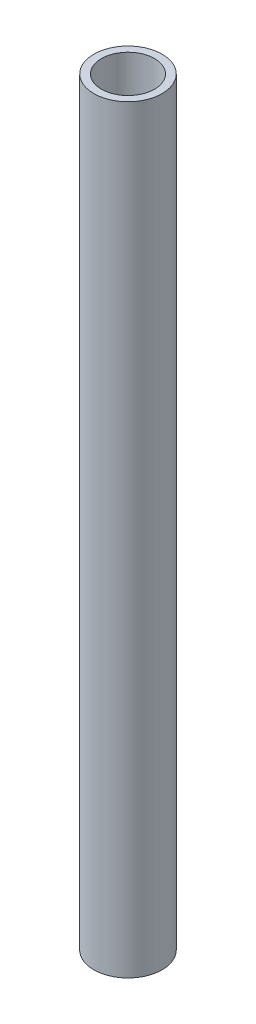
ISO-10303-21;
HEADER;
FILE_DESCRIPTION(('STEP AP214'),'2;1');
FILE_NAME('part.step','',(''),(''),'','','');
FILE_SCHEMA(('AUTOMOTIVE_DESIGN { 1 0 10303 214 1 1 1 1 }'));
ENDSEC;
DATA;
#1=APPLICATION_CONTEXT('core data for automotive mechanical design processes');
#2=APPLICATION_PROTOCOL_DEFINITION('international standard','automotive_design',2000,#1);
#3=PRODUCT_CONTEXT('',#1,'mechanical');
#4=PRODUCT('Part','Part','',(#3));
#5=PRODUCT_RELATED_PRODUCT_CATEGORY('part','',(#4));
#6=PRODUCT_DEFINITION_FORMATION('','',#4);
#7=PRODUCT_DEFINITION_CONTEXT('part definition',#1,'design');
#8=PRODUCT_DEFINITION('design','',#6,#7);
#9=PRODUCT_DEFINITION_SHAPE('','',#8);
#10=(LENGTH_UNIT() NAMED_UNIT(*) SI_UNIT(.MILLI.,.METRE.));
#11=(NAMED_UNIT(*) PLANE_ANGLE_UNIT() SI_UNIT($,.RADIAN.));
#12=(NAMED_UNIT(*) SI_UNIT($,.STERADIAN.) SOLID_ANGLE_UNIT());
#13=UNCERTAINTY_MEASURE_WITH_UNIT(LENGTH_MEASURE(1.E-05),#10,'distance_accuracy_value','');
#14=(GEOMETRIC_REPRESENTATION_CONTEXT(3) GLOBAL_UNCERTAINTY_ASSIGNED_CONTEXT((#13)) GLOBAL_UNIT_ASSIGNED_CONTEXT((#10,
#11,#12)) REPRESENTATION_CONTEXT('',''));
#15=CARTESIAN_POINT('',(0.,0.,0.));
#16=DIRECTION('',(0.,0.,1.));
#17=DIRECTION('',(1.,0.,0.));
#18=AXIS2_PLACEMENT_3D('',#15,#16,#17);
#19=CARTESIAN_POINT('',(0.,200.,0.));
#20=DIRECTION('',(0.,1.,0.));
#21=DIRECTION('',(0.,0.,1.));
#22=AXIS2_PLACEMENT_3D('',#19,#20,#21);
#23=PLANE('',#22);
#24=CARTESIAN_POINT('',(0.,200.,0.));
#25=DIRECTION('',(0.,1.,0.));
#26=DIRECTION('',(0.,0.,1.));
#27=AXIS2_PLACEMENT_3D('',#24,#25,#26);
#28=CIRCLE('',#27,9.);
#29=CARTESIAN_POINT('',(0.,200.,9.));
#30=VERTEX_POINT('',#29);
#31=EDGE_CURVE('E10',#30,#30,#28,.T.);
#32=ORIENTED_EDGE('',*,*,#31,.T.);
#33=EDGE_LOOP('',(#32));
#34=FACE_BOUND('',#33,.T.);
#35=CARTESIAN_POINT('',(0.,200.,0.));
#36=DIRECTION('',(0.,1.,0.));
#37=DIRECTION('',(0.,0.,1.));
#38=AXIS2_PLACEMENT_3D('',#35,#36,#37);
#39=CIRCLE('',#38,7.);
#40=CARTESIAN_POINT('',(0.,200.,7.));
#41=VERTEX_POINT('',#40);
#42=EDGE_CURVE('E43',#41,#41,#39,.T.);
#43=ORIENTED_EDGE('',*,*,#42,.F.);
#44=EDGE_LOOP('',(#43));
#45=FACE_BOUND('',#44,.T.);
#46=ADVANCED_FACE('F32',(#34,#45),#23,.T.);
#47=CARTESIAN_POINT('',(0.,0.,0.));
#48=DIRECTION('',(0.,1.,0.));
#49=DIRECTION('',(0.,0.,1.));
#50=AXIS2_PLACEMENT_3D('',#47,#48,#49);
#51=PLANE('',#50);
#52=CARTESIAN_POINT('',(0.,0.,0.));
#53=DIRECTION('',(0.,1.,0.));
#54=DIRECTION('',(0.,0.,1.));
#55=AXIS2_PLACEMENT_3D('',#52,#53,#54);
#56=CIRCLE('',#55,9.);
#57=CARTESIAN_POINT('',(0.,0.,9.));
#58=VERTEX_POINT('',#57);
#59=EDGE_CURVE('E36',#58,#58,#56,.T.);
#60=ORIENTED_EDGE('',*,*,#59,.F.);
#61=EDGE_LOOP('',(#60));
#62=FACE_BOUND('',#61,.T.);
#63=CARTESIAN_POINT('',(0.,0.,0.));
#64=DIRECTION('',(0.,1.,0.));
#65=DIRECTION('',(0.,0.,1.));
#66=AXIS2_PLACEMENT_3D('',#63,#64,#65);
#67=CIRCLE('',#66,7.);
#68=CARTESIAN_POINT('',(0.,0.,7.));
#69=VERTEX_POINT('',#68);
#70=EDGE_CURVE('E45',#69,#69,#67,.T.);
#71=ORIENTED_EDGE('',*,*,#70,.T.);
#72=EDGE_LOOP('',(#71));
#73=FACE_BOUND('',#72,.T.);
#74=ADVANCED_FACE('F55',(#62,#73),#51,.F.);
#75=CARTESIAN_POINT('',(0.,200.,0.));
#76=DIRECTION('',(0.,-1.,0.));
#77=DIRECTION('',(0.,0.,-1.));
#78=AXIS2_PLACEMENT_3D('',#75,#76,#77);
#79=CYLINDRICAL_SURFACE('',#78,9.);
#80=ORIENTED_EDGE('',*,*,#31,.F.);
#81=EDGE_LOOP('',(#80));
#82=FACE_BOUND('',#81,.T.);
#83=ORIENTED_EDGE('',*,*,#59,.T.);
#84=EDGE_LOOP('',(#83));
#85=FACE_BOUND('',#84,.T.);
#86=ADVANCED_FACE('F34',(#82,#85),#79,.T.);
#87=CARTESIAN_POINT('',(0.,200.,0.));
#88=DIRECTION('',(0.,-1.,0.));
#89=DIRECTION('',(0.,0.,-1.));
#90=AXIS2_PLACEMENT_3D('',#87,#88,#89);
#91=CYLINDRICAL_SURFACE('',#90,7.);
#92=ORIENTED_EDGE('',*,*,#42,.T.);
#93=EDGE_LOOP('',(#92));
#94=FACE_BOUND('',#93,.T.);
#95=ORIENTED_EDGE('',*,*,#70,.F.);
#96=EDGE_LOOP('',(#95));
#97=FACE_BOUND('',#96,.T.);
#98=ADVANCED_FACE('F51',(#94,#97),#91,.F.);
#99=CLOSED_SHELL('',(#46,#74,#86,#98));
#100=MANIFOLD_SOLID_BREP('B2',#99);
#101=ADVANCED_BREP_SHAPE_REPRESENTATION('',(#18,#100),#14);
#102=SHAPE_DEFINITION_REPRESENTATION(#9,#101);
ENDSEC;
END-ISO-10303-21;
